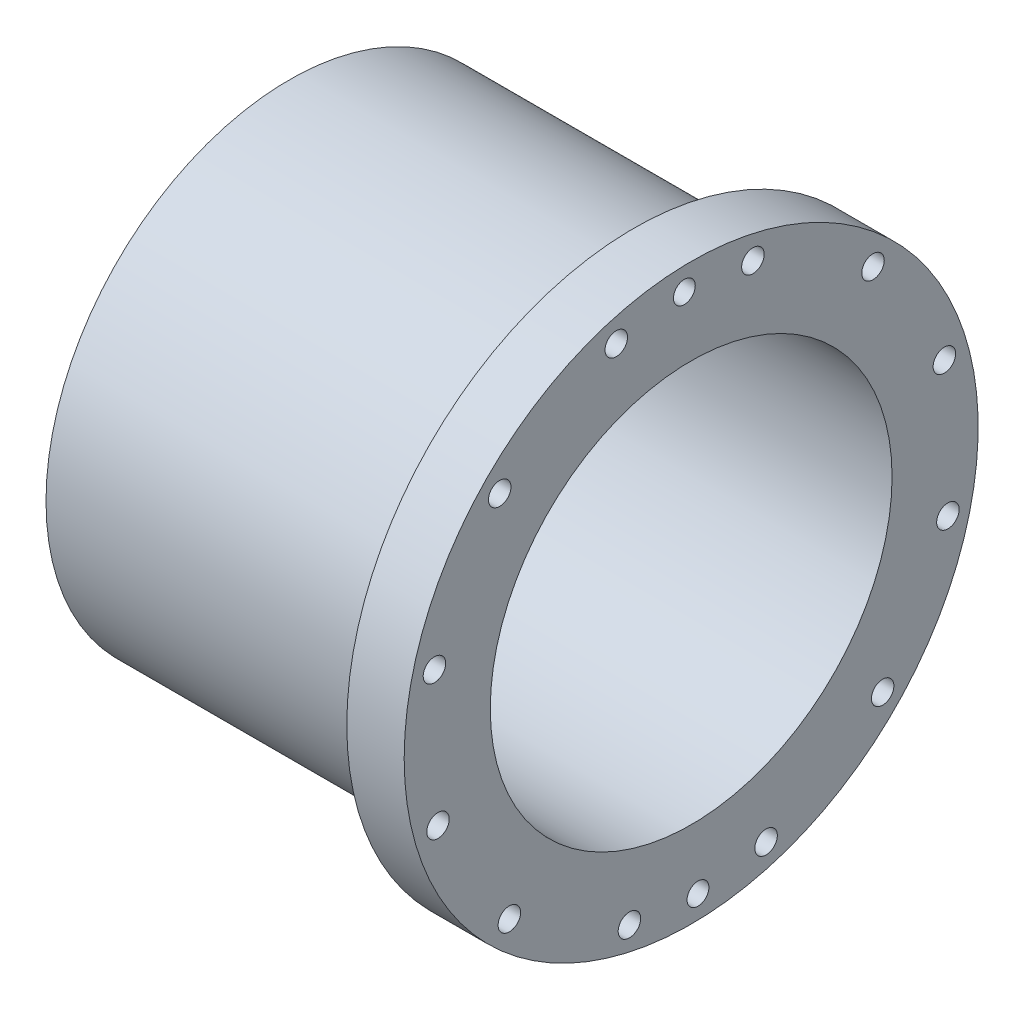
ISO-10303-21;
HEADER;
FILE_DESCRIPTION(('STEP AP214'),'2;1');
FILE_NAME('part.step','',(''),(''),'','','');
FILE_SCHEMA(('AUTOMOTIVE_DESIGN { 1 0 10303 214 1 1 1 1 }'));
ENDSEC;
DATA;
#1=APPLICATION_CONTEXT('core data for automotive mechanical design processes');
#2=APPLICATION_PROTOCOL_DEFINITION('international standard','automotive_design',2000,#1);
#3=PRODUCT_CONTEXT('',#1,'mechanical');
#4=PRODUCT('Part','Part','',(#3));
#5=PRODUCT_RELATED_PRODUCT_CATEGORY('part','',(#4));
#6=PRODUCT_DEFINITION_FORMATION('','',#4);
#7=PRODUCT_DEFINITION_CONTEXT('part definition',#1,'design');
#8=PRODUCT_DEFINITION('design','',#6,#7);
#9=PRODUCT_DEFINITION_SHAPE('','',#8);
#10=(LENGTH_UNIT() NAMED_UNIT(*) SI_UNIT(.MILLI.,.METRE.));
#11=(NAMED_UNIT(*) PLANE_ANGLE_UNIT() SI_UNIT($,.RADIAN.));
#12=(NAMED_UNIT(*) SI_UNIT($,.STERADIAN.) SOLID_ANGLE_UNIT());
#13=UNCERTAINTY_MEASURE_WITH_UNIT(LENGTH_MEASURE(1.E-05),#10,'distance_accuracy_value','');
#14=(GEOMETRIC_REPRESENTATION_CONTEXT(3) GLOBAL_UNCERTAINTY_ASSIGNED_CONTEXT((#13)) GLOBAL_UNIT_ASSIGNED_CONTEXT((#10,
#11,#12)) REPRESENTATION_CONTEXT('',''));
#15=CARTESIAN_POINT('',(0.,0.,0.));
#16=DIRECTION('',(0.,0.,1.));
#17=DIRECTION('',(1.,0.,0.));
#18=AXIS2_PLACEMENT_3D('',#15,#16,#17);
#19=CARTESIAN_POINT('',(-87.2836363636364,0.,0.));
#20=DIRECTION('',(-1.,0.,0.));
#21=DIRECTION('',(0.,0.,1.));
#22=AXIS2_PLACEMENT_3D('',#19,#20,#21);
#23=CYLINDRICAL_SURFACE('',#22,53.848);
#24=CARTESIAN_POINT('',(-88.9,0.,0.));
#25=DIRECTION('',(-1.,0.,0.));
#26=DIRECTION('',(0.,0.,1.));
#27=AXIS2_PLACEMENT_3D('',#24,#25,#26);
#28=CIRCLE('',#27,53.848);
#29=CARTESIAN_POINT('',(-88.9,0.,53.848));
#30=VERTEX_POINT('',#29);
#31=EDGE_CURVE('E11',#30,#30,#28,.T.);
#32=ORIENTED_EDGE('',*,*,#31,.F.);
#33=EDGE_LOOP('',(#32));
#34=FACE_BOUND('',#33,.T.);
#35=CARTESIAN_POINT('',(-12.7,0.,0.));
#36=DIRECTION('',(-1.,0.,0.));
#37=DIRECTION('',(0.,0.,1.));
#38=AXIS2_PLACEMENT_3D('',#35,#36,#37);
#39=CIRCLE('',#38,53.848);
#40=CARTESIAN_POINT('',(-12.7,0.,53.848));
#41=VERTEX_POINT('',#40);
#42=EDGE_CURVE('E164',#41,#41,#39,.T.);
#43=ORIENTED_EDGE('',*,*,#42,.T.);
#44=EDGE_LOOP('',(#43));
#45=FACE_BOUND('',#44,.T.);
#46=ADVANCED_FACE('F34',(#34,#45),#23,.T.);
#47=CARTESIAN_POINT('',(-88.9,53.848,0.));
#48=DIRECTION('',(1.,0.,0.));
#49=DIRECTION('',(0.,0.,-1.));
#50=AXIS2_PLACEMENT_3D('',#47,#48,#49);
#51=PLANE('',#50);
#52=CARTESIAN_POINT('',(-88.9,35.6389185711947,-33.8451131491055));
#53=DIRECTION('',(-1.,0.,0.));
#54=DIRECTION('',(0.,0.,1.));
#55=AXIS2_PLACEMENT_3D('',#52,#53,#54);
#56=CIRCLE('',#55,2.01929999999999);
#57=CARTESIAN_POINT('',(-88.9,35.6389185711947,-31.8258131491055));
#58=VERTEX_POINT('',#57);
#59=EDGE_CURVE('E79',#58,#58,#56,.T.);
#60=ORIENTED_EDGE('',*,*,#59,.F.);
#61=EDGE_LOOP('',(#60));
#62=FACE_BOUND('',#61,.T.);
#63=CARTESIAN_POINT('',(-88.9,49.1326300136069,1.26841197808898));
#64=DIRECTION('',(-1.,0.,0.));
#65=DIRECTION('',(0.,0.,1.));
#66=AXIS2_PLACEMENT_3D('',#63,#64,#65);
#67=CIRCLE('',#66,2.01929999999999);
#68=CARTESIAN_POINT('',(-88.9,49.1326300136069,3.28771197808898));
#69=VERTEX_POINT('',#68);
#70=EDGE_CURVE('E78',#69,#69,#67,.T.);
#71=ORIENTED_EDGE('',*,*,#70,.F.);
#72=EDGE_LOOP('',(#71));
#73=FACE_BOUND('',#72,.T.);
#74=CARTESIAN_POINT('',(-88.9,33.8451131491076,35.6389185711965));
#75=DIRECTION('',(-1.,0.,0.));
#76=DIRECTION('',(0.,0.,1.));
#77=AXIS2_PLACEMENT_3D('',#74,#75,#76);
#78=CIRCLE('',#77,2.01929999999999);
#79=CARTESIAN_POINT('',(-88.9,33.8451131491076,37.6582185711965));
#80=VERTEX_POINT('',#79);
#81=EDGE_CURVE('E91',#80,#80,#78,.T.);
#82=ORIENTED_EDGE('',*,*,#81,.F.);
#83=EDGE_LOOP('',(#82));
#84=FACE_BOUND('',#83,.T.);
#85=CARTESIAN_POINT('',(-88.9,-1.26841197808681,49.1326300136087));
#86=DIRECTION('',(-1.,0.,0.));
#87=DIRECTION('',(0.,0.,1.));
#88=AXIS2_PLACEMENT_3D('',#85,#86,#87);
#89=CIRCLE('',#88,2.0193);
#90=CARTESIAN_POINT('',(-88.9,-1.26841197808681,51.1519300136087));
#91=VERTEX_POINT('',#90);
#92=EDGE_CURVE('E97',#91,#91,#89,.T.);
#93=ORIENTED_EDGE('',*,*,#92,.F.);
#94=EDGE_LOOP('',(#93));
#95=FACE_BOUND('',#94,.T.);
#96=CARTESIAN_POINT('',(-88.9,-35.6389185711944,33.8451131491094));
#97=DIRECTION('',(-1.,0.,0.));
#98=DIRECTION('',(0.,0.,1.));
#99=AXIS2_PLACEMENT_3D('',#96,#97,#98);
#100=CIRCLE('',#99,2.01929999999999);
#101=CARTESIAN_POINT('',(-88.9,-35.6389185711944,35.8644131491094));
#102=VERTEX_POINT('',#101);
#103=EDGE_CURVE('E103',#102,#102,#100,.T.);
#104=ORIENTED_EDGE('',*,*,#103,.F.);
#105=EDGE_LOOP('',(#104));
#106=FACE_BOUND('',#105,.T.);
#107=CARTESIAN_POINT('',(-88.9,-49.1326300136066,-1.26841197808499));
#108=DIRECTION('',(-1.,0.,0.));
#109=DIRECTION('',(0.,0.,1.));
#110=AXIS2_PLACEMENT_3D('',#107,#108,#109);
#111=CIRCLE('',#110,2.01929999999999);
#112=CARTESIAN_POINT('',(-88.9,-49.1326300136066,0.750888021915));
#113=VERTEX_POINT('',#112);
#114=EDGE_CURVE('E109',#113,#113,#111,.T.);
#115=ORIENTED_EDGE('',*,*,#114,.F.);
#116=EDGE_LOOP('',(#115));
#117=FACE_BOUND('',#116,.T.);
#118=CARTESIAN_POINT('',(-88.9,-33.8451131491073,-35.6389185711926));
#119=DIRECTION('',(-1.,0.,0.));
#120=DIRECTION('',(0.,0.,1.));
#121=AXIS2_PLACEMENT_3D('',#118,#119,#120);
#122=CIRCLE('',#121,2.01929999999999);
#123=CARTESIAN_POINT('',(-88.9,-33.8451131491073,-33.6196185711926));
#124=VERTEX_POINT('',#123);
#125=EDGE_CURVE('E115',#124,#124,#122,.T.);
#126=ORIENTED_EDGE('',*,*,#125,.F.);
#127=EDGE_LOOP('',(#126));
#128=FACE_BOUND('',#127,.T.);
#129=CARTESIAN_POINT('',(-88.9,1.26841197808717,-49.1326300136047));
#130=DIRECTION('',(-1.,0.,0.));
#131=DIRECTION('',(0.,0.,1.));
#132=AXIS2_PLACEMENT_3D('',#129,#130,#131);
#133=CIRCLE('',#132,2.0193);
#134=CARTESIAN_POINT('',(-88.9,1.26841197808717,-47.1133300136047));
#135=VERTEX_POINT('',#134);
#136=EDGE_CURVE('E121',#135,#135,#133,.T.);
#137=ORIENTED_EDGE('',*,*,#136,.F.);
#138=EDGE_LOOP('',(#137));
#139=FACE_BOUND('',#138,.T.);
#140=CARTESIAN_POINT('',(-88.9,0.,0.));
#141=DIRECTION('',(-1.,0.,0.));
#142=DIRECTION('',(0.,0.,1.));
#143=AXIS2_PLACEMENT_3D('',#140,#141,#142);
#144=CIRCLE('',#143,44.45);
#145=CARTESIAN_POINT('',(-88.9,0.,44.45));
#146=VERTEX_POINT('',#145);
#147=EDGE_CURVE('E42',#146,#146,#144,.T.);
#148=ORIENTED_EDGE('',*,*,#147,.F.);
#149=EDGE_LOOP('',(#148));
#150=FACE_BOUND('',#149,.T.);
#151=ORIENTED_EDGE('',*,*,#31,.T.);
#152=EDGE_LOOP('',(#151));
#153=FACE_BOUND('',#152,.T.);
#154=ADVANCED_FACE('F232',(#62,#73,#84,#95,#106,#117,#128,#139,#150,#153),#51,.F.);
#155=CARTESIAN_POINT('',(-87.2836363636364,0.,0.));
#156=DIRECTION('',(-1.,0.,0.));
#157=DIRECTION('',(0.,0.,1.));
#158=AXIS2_PLACEMENT_3D('',#155,#156,#157);
#159=CYLINDRICAL_SURFACE('',#158,44.45);
#160=CARTESIAN_POINT('',(0.,0.,0.));
#161=DIRECTION('',(-1.,0.,0.));
#162=DIRECTION('',(0.,0.,1.));
#163=AXIS2_PLACEMENT_3D('',#160,#161,#162);
#164=CIRCLE('',#163,44.45);
#165=CARTESIAN_POINT('',(0.,0.,44.45));
#166=VERTEX_POINT('',#165);
#167=EDGE_CURVE('E173',#166,#166,#164,.T.);
#168=ORIENTED_EDGE('',*,*,#167,.F.);
#169=EDGE_LOOP('',(#168));
#170=FACE_BOUND('',#169,.T.);
#171=ORIENTED_EDGE('',*,*,#147,.T.);
#172=EDGE_LOOP('',(#171));
#173=FACE_BOUND('',#172,.T.);
#174=ADVANCED_FACE('F237',(#170,#173),#159,.F.);
#175=CARTESIAN_POINT('',(0.,44.45,0.));
#176=DIRECTION('',(-1.,0.,0.));
#177=DIRECTION('',(0.,0.,1.));
#178=AXIS2_PLACEMENT_3D('',#175,#176,#177);
#179=PLANE('',#178);
#180=CARTESIAN_POINT('',(0.,58.4005421350349,1.5076731522501));
#181=DIRECTION('',(1.,0.,0.));
#182=DIRECTION('',(0.,0.,-1.));
#183=AXIS2_PLACEMENT_3D('',#180,#181,#182);
#184=CIRCLE('',#183,2.413);
#185=CARTESIAN_POINT('',(0.,58.4005421350349,-0.905326847749895));
#186=VERTEX_POINT('',#185);
#187=EDGE_CURVE('E406',#186,#186,#184,.T.);
#188=ORIENTED_EDGE('',*,*,#187,.F.);
#189=EDGE_LOOP('',(#188));
#190=FACE_BOUND('',#189,.T.);
#191=CARTESIAN_POINT('',(0.,-58.4005421350349,-1.5076731522501));
#192=DIRECTION('',(1.,0.,0.));
#193=DIRECTION('',(0.,0.,-1.));
#194=AXIS2_PLACEMENT_3D('',#191,#192,#193);
#195=CIRCLE('',#194,2.413);
#196=CARTESIAN_POINT('',(0.,-58.4005421350349,-3.9206731522501));
#197=VERTEX_POINT('',#196);
#198=EDGE_CURVE('E413',#197,#197,#195,.T.);
#199=ORIENTED_EDGE('',*,*,#198,.F.);
#200=EDGE_LOOP('',(#199));
#201=FACE_BOUND('',#200,.T.);
#202=CARTESIAN_POINT('',(0.,56.8008064431053,-13.6588721134983));
#203=DIRECTION('',(1.,0.,0.));
#204=DIRECTION('',(0.,0.,-1.));
#205=AXIS2_PLACEMENT_3D('',#202,#203,#204);
#206=CIRCLE('',#205,2.4892);
#207=CARTESIAN_POINT('',(0.,56.8008064431053,-16.1480721134983));
#208=VERTEX_POINT('',#207);
#209=EDGE_CURVE('E137',#208,#208,#206,.T.);
#210=ORIENTED_EDGE('',*,*,#209,.F.);
#211=EDGE_LOOP('',(#210));
#212=FACE_BOUND('',#211,.T.);
#213=CARTESIAN_POINT('',(0.,42.3615052784228,-40.2293334588851));
#214=DIRECTION('',(1.,0.,0.));
#215=DIRECTION('',(0.,0.,-1.));
#216=AXIS2_PLACEMENT_3D('',#213,#214,#215);
#217=CIRCLE('',#216,2.4892);
#218=CARTESIAN_POINT('',(0.,42.3615052784228,-42.7185334588851));
#219=VERTEX_POINT('',#218);
#220=EDGE_CURVE('E141',#219,#219,#217,.T.);
#221=ORIENTED_EDGE('',*,*,#220,.F.);
#222=EDGE_LOOP('',(#221));
#223=FACE_BOUND('',#222,.T.);
#224=CARTESIAN_POINT('',(0.,16.5714729842201,-56.0203773919213));
#225=DIRECTION('',(1.,0.,0.));
#226=DIRECTION('',(0.,0.,-1.));
#227=AXIS2_PLACEMENT_3D('',#224,#225,#226);
#228=CIRCLE('',#227,2.4892);
#229=CARTESIAN_POINT('',(0.,16.5714729842201,-58.5095773919213));
#230=VERTEX_POINT('',#229);
#231=EDGE_CURVE('E144',#230,#230,#228,.T.);
#232=ORIENTED_EDGE('',*,*,#231,.F.);
#233=EDGE_LOOP('',(#232));
#234=FACE_BOUND('',#233,.T.);
#235=CARTESIAN_POINT('',(0.,-13.6588721134985,-56.8008064431055));
#236=DIRECTION('',(1.,0.,0.));
#237=DIRECTION('',(0.,0.,-1.));
#238=AXIS2_PLACEMENT_3D('',#235,#236,#237);
#239=CIRCLE('',#238,2.4892);
#240=CARTESIAN_POINT('',(0.,-13.6588721134985,-59.2900064431055));
#241=VERTEX_POINT('',#240);
#242=EDGE_CURVE('E147',#241,#241,#239,.T.);
#243=ORIENTED_EDGE('',*,*,#242,.F.);
#244=EDGE_LOOP('',(#243));
#245=FACE_BOUND('',#244,.T.);
#246=CARTESIAN_POINT('',(0.,-40.2293334588853,-42.361505278423));
#247=DIRECTION('',(1.,0.,0.));
#248=DIRECTION('',(0.,0.,-1.));
#249=AXIS2_PLACEMENT_3D('',#246,#247,#248);
#250=CIRCLE('',#249,2.4892);
#251=CARTESIAN_POINT('',(0.,-40.2293334588853,-44.850705278423));
#252=VERTEX_POINT('',#251);
#253=EDGE_CURVE('E150',#252,#252,#250,.T.);
#254=ORIENTED_EDGE('',*,*,#253,.F.);
#255=EDGE_LOOP('',(#254));
#256=FACE_BOUND('',#255,.T.);
#257=CARTESIAN_POINT('',(0.,-56.0203773919216,-16.5714729842203));
#258=DIRECTION('',(1.,0.,0.));
#259=DIRECTION('',(0.,0.,-1.));
#260=AXIS2_PLACEMENT_3D('',#257,#258,#259);
#261=CIRCLE('',#260,2.4892);
#262=CARTESIAN_POINT('',(0.,-56.0203773919216,-19.0606729842203));
#263=VERTEX_POINT('',#262);
#264=EDGE_CURVE('E153',#263,#263,#261,.T.);
#265=ORIENTED_EDGE('',*,*,#264,.F.);
#266=EDGE_LOOP('',(#265));
#267=FACE_BOUND('',#266,.T.);
#268=CARTESIAN_POINT('',(0.,-56.8008064431057,13.6588721134983));
#269=DIRECTION('',(1.,0.,0.));
#270=DIRECTION('',(0.,0.,-1.));
#271=AXIS2_PLACEMENT_3D('',#268,#269,#270);
#272=CIRCLE('',#271,2.4892);
#273=CARTESIAN_POINT('',(0.,-56.8008064431057,11.1696721134983));
#274=VERTEX_POINT('',#273);
#275=EDGE_CURVE('E156',#274,#274,#272,.T.);
#276=ORIENTED_EDGE('',*,*,#275,.F.);
#277=EDGE_LOOP('',(#276));
#278=FACE_BOUND('',#277,.T.);
#279=CARTESIAN_POINT('',(0.,-42.3615052784233,40.2293334588851));
#280=DIRECTION('',(1.,0.,0.));
#281=DIRECTION('',(0.,0.,-1.));
#282=AXIS2_PLACEMENT_3D('',#279,#280,#281);
#283=CIRCLE('',#282,2.4892);
#284=CARTESIAN_POINT('',(0.,-42.3615052784233,37.7401334588851));
#285=VERTEX_POINT('',#284);
#286=EDGE_CURVE('E131',#285,#285,#283,.T.);
#287=ORIENTED_EDGE('',*,*,#286,.F.);
#288=EDGE_LOOP('',(#287));
#289=FACE_BOUND('',#288,.T.);
#290=CARTESIAN_POINT('',(0.,-16.5714729842206,56.0203773919213));
#291=DIRECTION('',(1.,0.,0.));
#292=DIRECTION('',(0.,0.,-1.));
#293=AXIS2_PLACEMENT_3D('',#290,#291,#292);
#294=CIRCLE('',#293,2.4892);
#295=CARTESIAN_POINT('',(0.,-16.5714729842206,53.5311773919213));
#296=VERTEX_POINT('',#295);
#297=EDGE_CURVE('E128',#296,#296,#294,.T.);
#298=ORIENTED_EDGE('',*,*,#297,.F.);
#299=EDGE_LOOP('',(#298));
#300=FACE_BOUND('',#299,.T.);
#301=CARTESIAN_POINT('',(0.,13.6588721134981,56.8008064431055));
#302=DIRECTION('',(1.,0.,0.));
#303=DIRECTION('',(0.,0.,-1.));
#304=AXIS2_PLACEMENT_3D('',#301,#302,#303);
#305=CIRCLE('',#304,2.4892);
#306=CARTESIAN_POINT('',(0.,13.6588721134981,54.3116064431055));
#307=VERTEX_POINT('',#306);
#308=EDGE_CURVE('E132',#307,#307,#305,.T.);
#309=ORIENTED_EDGE('',*,*,#308,.F.);
#310=EDGE_LOOP('',(#309));
#311=FACE_BOUND('',#310,.T.);
#312=CARTESIAN_POINT('',(0.,40.2293334588849,42.361505278423));
#313=DIRECTION('',(1.,0.,0.));
#314=DIRECTION('',(0.,0.,-1.));
#315=AXIS2_PLACEMENT_3D('',#312,#313,#314);
#316=CIRCLE('',#315,2.4892);
#317=CARTESIAN_POINT('',(0.,40.2293334588849,39.872305278423));
#318=VERTEX_POINT('',#317);
#319=EDGE_CURVE('E127',#318,#318,#316,.T.);
#320=ORIENTED_EDGE('',*,*,#319,.F.);
#321=EDGE_LOOP('',(#320));
#322=FACE_BOUND('',#321,.T.);
#323=CARTESIAN_POINT('',(0.,56.0203773919211,16.5714729842204));
#324=DIRECTION('',(1.,0.,0.));
#325=DIRECTION('',(0.,0.,-1.));
#326=AXIS2_PLACEMENT_3D('',#323,#324,#325);
#327=CIRCLE('',#326,2.4892);
#328=CARTESIAN_POINT('',(0.,56.0203773919211,14.0822729842204));
#329=VERTEX_POINT('',#328);
#330=EDGE_CURVE('E140',#329,#329,#327,.T.);
#331=ORIENTED_EDGE('',*,*,#330,.F.);
#332=EDGE_LOOP('',(#331));
#333=FACE_BOUND('',#332,.T.);
#334=CARTESIAN_POINT('',(0.,0.,0.));
#335=DIRECTION('',(-1.,0.,0.));
#336=DIRECTION('',(0.,0.,1.));
#337=AXIS2_PLACEMENT_3D('',#334,#335,#336);
#338=CIRCLE('',#337,63.5);
#339=CARTESIAN_POINT('',(0.,0.,63.5));
#340=VERTEX_POINT('',#339);
#341=EDGE_CURVE('E170',#340,#340,#338,.T.);
#342=ORIENTED_EDGE('',*,*,#341,.F.);
#343=EDGE_LOOP('',(#342));
#344=FACE_BOUND('',#343,.T.);
#345=ORIENTED_EDGE('',*,*,#167,.T.);
#346=EDGE_LOOP('',(#345));
#347=FACE_BOUND('',#346,.T.);
#348=ADVANCED_FACE('F252',(#190,#201,#212,#223,#234,#245,#256,#267,#278,#289,#300,#311,#322,
#333,#344,#347),#179,.F.);
#349=CARTESIAN_POINT('',(-87.2836363636364,0.,0.));
#350=DIRECTION('',(-1.,0.,0.));
#351=DIRECTION('',(0.,0.,1.));
#352=AXIS2_PLACEMENT_3D('',#349,#350,#351);
#353=CYLINDRICAL_SURFACE('',#352,63.5);
#354=CARTESIAN_POINT('',(-12.7,0.,0.));
#355=DIRECTION('',(-1.,0.,0.));
#356=DIRECTION('',(0.,0.,1.));
#357=AXIS2_PLACEMENT_3D('',#354,#355,#356);
#358=CIRCLE('',#357,63.5);
#359=CARTESIAN_POINT('',(-12.7,0.,63.5));
#360=VERTEX_POINT('',#359);
#361=EDGE_CURVE('E167',#360,#360,#358,.T.);
#362=ORIENTED_EDGE('',*,*,#361,.F.);
#363=EDGE_LOOP('',(#362));
#364=FACE_BOUND('',#363,.T.);
#365=ORIENTED_EDGE('',*,*,#341,.T.);
#366=EDGE_LOOP('',(#365));
#367=FACE_BOUND('',#366,.T.);
#368=ADVANCED_FACE('F246',(#364,#367),#353,.T.);
#369=CARTESIAN_POINT('',(-12.7,63.5,0.));
#370=DIRECTION('',(1.,0.,0.));
#371=DIRECTION('',(0.,0.,-1.));
#372=AXIS2_PLACEMENT_3D('',#369,#370,#371);
#373=PLANE('',#372);
#374=CARTESIAN_POINT('',(-12.7,56.8008064431053,-13.6588721134983));
#375=DIRECTION('',(1.,0.,0.));
#376=DIRECTION('',(0.,0.,-1.));
#377=AXIS2_PLACEMENT_3D('',#374,#375,#376);
#378=CIRCLE('',#377,2.4892);
#379=CARTESIAN_POINT('',(-12.7,56.8008064431053,-16.1480721134983));
#380=VERTEX_POINT('',#379);
#381=EDGE_CURVE('E37',#380,#380,#378,.T.);
#382=ORIENTED_EDGE('',*,*,#381,.T.);
#383=EDGE_LOOP('',(#382));
#384=FACE_BOUND('',#383,.T.);
#385=CARTESIAN_POINT('',(-12.7,42.3615052784228,-40.2293334588851));
#386=DIRECTION('',(1.,0.,0.));
#387=DIRECTION('',(0.,0.,-1.));
#388=AXIS2_PLACEMENT_3D('',#385,#386,#387);
#389=CIRCLE('',#388,2.4892);
#390=CARTESIAN_POINT('',(-12.7,42.3615052784228,-42.7185334588851));
#391=VERTEX_POINT('',#390);
#392=EDGE_CURVE('E206',#391,#391,#389,.T.);
#393=ORIENTED_EDGE('',*,*,#392,.T.);
#394=EDGE_LOOP('',(#393));
#395=FACE_BOUND('',#394,.T.);
#396=CARTESIAN_POINT('',(-12.7,16.5714729842201,-56.0203773919213));
#397=DIRECTION('',(1.,0.,0.));
#398=DIRECTION('',(0.,0.,-1.));
#399=AXIS2_PLACEMENT_3D('',#396,#397,#398);
#400=CIRCLE('',#399,2.4892);
#401=CARTESIAN_POINT('',(-12.7,16.5714729842201,-58.5095773919213));
#402=VERTEX_POINT('',#401);
#403=EDGE_CURVE('E204',#402,#402,#400,.T.);
#404=ORIENTED_EDGE('',*,*,#403,.T.);
#405=EDGE_LOOP('',(#404));
#406=FACE_BOUND('',#405,.T.);
#407=CARTESIAN_POINT('',(-12.7,-13.6588721134985,-56.8008064431055));
#408=DIRECTION('',(1.,0.,0.));
#409=DIRECTION('',(0.,0.,-1.));
#410=AXIS2_PLACEMENT_3D('',#407,#408,#409);
#411=CIRCLE('',#410,2.4892);
#412=CARTESIAN_POINT('',(-12.7,-13.6588721134985,-59.2900064431055));
#413=VERTEX_POINT('',#412);
#414=EDGE_CURVE('E201',#413,#413,#411,.T.);
#415=ORIENTED_EDGE('',*,*,#414,.T.);
#416=EDGE_LOOP('',(#415));
#417=FACE_BOUND('',#416,.T.);
#418=CARTESIAN_POINT('',(-12.7,-40.2293334588853,-42.361505278423));
#419=DIRECTION('',(1.,0.,0.));
#420=DIRECTION('',(0.,0.,-1.));
#421=AXIS2_PLACEMENT_3D('',#418,#419,#420);
#422=CIRCLE('',#421,2.4892);
#423=CARTESIAN_POINT('',(-12.7,-40.2293334588853,-44.850705278423));
#424=VERTEX_POINT('',#423);
#425=EDGE_CURVE('E198',#424,#424,#422,.T.);
#426=ORIENTED_EDGE('',*,*,#425,.T.);
#427=EDGE_LOOP('',(#426));
#428=FACE_BOUND('',#427,.T.);
#429=CARTESIAN_POINT('',(-12.7,-56.0203773919216,-16.5714729842203));
#430=DIRECTION('',(1.,0.,0.));
#431=DIRECTION('',(0.,0.,-1.));
#432=AXIS2_PLACEMENT_3D('',#429,#430,#431);
#433=CIRCLE('',#432,2.4892);
#434=CARTESIAN_POINT('',(-12.7,-56.0203773919216,-19.0606729842203));
#435=VERTEX_POINT('',#434);
#436=EDGE_CURVE('E195',#435,#435,#433,.T.);
#437=ORIENTED_EDGE('',*,*,#436,.T.);
#438=EDGE_LOOP('',(#437));
#439=FACE_BOUND('',#438,.T.);
#440=CARTESIAN_POINT('',(-12.7,-56.8008064431057,13.6588721134983));
#441=DIRECTION('',(1.,0.,0.));
#442=DIRECTION('',(0.,0.,-1.));
#443=AXIS2_PLACEMENT_3D('',#440,#441,#442);
#444=CIRCLE('',#443,2.4892);
#445=CARTESIAN_POINT('',(-12.7,-56.8008064431057,11.1696721134983));
#446=VERTEX_POINT('',#445);
#447=EDGE_CURVE('E192',#446,#446,#444,.T.);
#448=ORIENTED_EDGE('',*,*,#447,.T.);
#449=EDGE_LOOP('',(#448));
#450=FACE_BOUND('',#449,.T.);
#451=CARTESIAN_POINT('',(-12.7,-42.3615052784233,40.2293334588851));
#452=DIRECTION('',(1.,0.,0.));
#453=DIRECTION('',(0.,0.,-1.));
#454=AXIS2_PLACEMENT_3D('',#451,#452,#453);
#455=CIRCLE('',#454,2.4892);
#456=CARTESIAN_POINT('',(-12.7,-42.3615052784233,37.7401334588851));
#457=VERTEX_POINT('',#456);
#458=EDGE_CURVE('E189',#457,#457,#455,.T.);
#459=ORIENTED_EDGE('',*,*,#458,.T.);
#460=EDGE_LOOP('',(#459));
#461=FACE_BOUND('',#460,.T.);
#462=CARTESIAN_POINT('',(-12.7,-16.5714729842206,56.0203773919213));
#463=DIRECTION('',(1.,0.,0.));
#464=DIRECTION('',(0.,0.,-1.));
#465=AXIS2_PLACEMENT_3D('',#462,#463,#464);
#466=CIRCLE('',#465,2.4892);
#467=CARTESIAN_POINT('',(-12.7,-16.5714729842206,53.5311773919213));
#468=VERTEX_POINT('',#467);
#469=EDGE_CURVE('E186',#468,#468,#466,.T.);
#470=ORIENTED_EDGE('',*,*,#469,.T.);
#471=EDGE_LOOP('',(#470));
#472=FACE_BOUND('',#471,.T.);
#473=CARTESIAN_POINT('',(-12.7,13.6588721134981,56.8008064431055));
#474=DIRECTION('',(1.,0.,0.));
#475=DIRECTION('',(0.,0.,-1.));
#476=AXIS2_PLACEMENT_3D('',#473,#474,#475);
#477=CIRCLE('',#476,2.4892);
#478=CARTESIAN_POINT('',(-12.7,13.6588721134981,54.3116064431055));
#479=VERTEX_POINT('',#478);
#480=EDGE_CURVE('E183',#479,#479,#477,.T.);
#481=ORIENTED_EDGE('',*,*,#480,.T.);
#482=EDGE_LOOP('',(#481));
#483=FACE_BOUND('',#482,.T.);
#484=CARTESIAN_POINT('',(-12.7,40.2293334588849,42.361505278423));
#485=DIRECTION('',(1.,0.,0.));
#486=DIRECTION('',(0.,0.,-1.));
#487=AXIS2_PLACEMENT_3D('',#484,#485,#486);
#488=CIRCLE('',#487,2.4892);
#489=CARTESIAN_POINT('',(-12.7,40.2293334588849,39.872305278423));
#490=VERTEX_POINT('',#489);
#491=EDGE_CURVE('E180',#490,#490,#488,.T.);
#492=ORIENTED_EDGE('',*,*,#491,.T.);
#493=EDGE_LOOP('',(#492));
#494=FACE_BOUND('',#493,.T.);
#495=CARTESIAN_POINT('',(-12.7,56.0203773919211,16.5714729842204));
#496=DIRECTION('',(1.,0.,0.));
#497=DIRECTION('',(0.,0.,-1.));
#498=AXIS2_PLACEMENT_3D('',#495,#496,#497);
#499=CIRCLE('',#498,2.4892);
#500=CARTESIAN_POINT('',(-12.7,56.0203773919211,14.0822729842204));
#501=VERTEX_POINT('',#500);
#502=EDGE_CURVE('E163',#501,#501,#499,.T.);
#503=ORIENTED_EDGE('',*,*,#502,.T.);
#504=EDGE_LOOP('',(#503));
#505=FACE_BOUND('',#504,.T.);
#506=ORIENTED_EDGE('',*,*,#42,.F.);
#507=EDGE_LOOP('',(#506));
#508=FACE_BOUND('',#507,.T.);
#509=ORIENTED_EDGE('',*,*,#361,.T.);
#510=EDGE_LOOP('',(#509));
#511=FACE_BOUND('',#510,.T.);
#512=ADVANCED_FACE('F213',(#384,#395,#406,#417,#428,#439,#450,#461,#472,#483,#494,#505,#508,
#511),#373,.F.);
#513=CARTESIAN_POINT('',(-88.9,56.0203773919211,16.5714729842204));
#514=DIRECTION('',(1.,0.,0.));
#515=DIRECTION('',(0.,0.,-1.));
#516=AXIS2_PLACEMENT_3D('',#513,#514,#515);
#517=CYLINDRICAL_SURFACE('',#516,2.4892);
#518=ORIENTED_EDGE('',*,*,#330,.T.);
#519=EDGE_LOOP('',(#518));
#520=FACE_BOUND('',#519,.T.);
#521=ORIENTED_EDGE('',*,*,#502,.F.);
#522=EDGE_LOOP('',(#521));
#523=FACE_BOUND('',#522,.T.);
#524=ADVANCED_FACE('F245',(#520,#523),#517,.F.);
#525=CARTESIAN_POINT('',(-88.9,40.2293334588849,42.361505278423));
#526=DIRECTION('',(1.,0.,0.));
#527=DIRECTION('',(0.,0.,-1.));
#528=AXIS2_PLACEMENT_3D('',#525,#526,#527);
#529=CYLINDRICAL_SURFACE('',#528,2.4892);
#530=ORIENTED_EDGE('',*,*,#319,.T.);
#531=EDGE_LOOP('',(#530));
#532=FACE_BOUND('',#531,.T.);
#533=ORIENTED_EDGE('',*,*,#491,.F.);
#534=EDGE_LOOP('',(#533));
#535=FACE_BOUND('',#534,.T.);
#536=ADVANCED_FACE('F273',(#532,#535),#529,.F.);
#537=CARTESIAN_POINT('',(-88.9,13.6588721134981,56.8008064431055));
#538=DIRECTION('',(1.,0.,0.));
#539=DIRECTION('',(0.,0.,-1.));
#540=AXIS2_PLACEMENT_3D('',#537,#538,#539);
#541=CYLINDRICAL_SURFACE('',#540,2.4892);
#542=ORIENTED_EDGE('',*,*,#308,.T.);
#543=EDGE_LOOP('',(#542));
#544=FACE_BOUND('',#543,.T.);
#545=ORIENTED_EDGE('',*,*,#480,.F.);
#546=EDGE_LOOP('',(#545));
#547=FACE_BOUND('',#546,.T.);
#548=ADVANCED_FACE('F325',(#544,#547),#541,.F.);
#549=CARTESIAN_POINT('',(-88.9,-16.5714729842206,56.0203773919213));
#550=DIRECTION('',(1.,0.,0.));
#551=DIRECTION('',(0.,0.,-1.));
#552=AXIS2_PLACEMENT_3D('',#549,#550,#551);
#553=CYLINDRICAL_SURFACE('',#552,2.4892);
#554=ORIENTED_EDGE('',*,*,#297,.T.);
#555=EDGE_LOOP('',(#554));
#556=FACE_BOUND('',#555,.T.);
#557=ORIENTED_EDGE('',*,*,#469,.F.);
#558=EDGE_LOOP('',(#557));
#559=FACE_BOUND('',#558,.T.);
#560=ADVANCED_FACE('F279',(#556,#559),#553,.F.);
#561=CARTESIAN_POINT('',(-88.9,-42.3615052784233,40.2293334588851));
#562=DIRECTION('',(1.,0.,0.));
#563=DIRECTION('',(0.,0.,-1.));
#564=AXIS2_PLACEMENT_3D('',#561,#562,#563);
#565=CYLINDRICAL_SURFACE('',#564,2.4892);
#566=ORIENTED_EDGE('',*,*,#286,.T.);
#567=EDGE_LOOP('',(#566));
#568=FACE_BOUND('',#567,.T.);
#569=ORIENTED_EDGE('',*,*,#458,.F.);
#570=EDGE_LOOP('',(#569));
#571=FACE_BOUND('',#570,.T.);
#572=ADVANCED_FACE('F275',(#568,#571),#565,.F.);
#573=CARTESIAN_POINT('',(-88.9,-56.8008064431057,13.6588721134983));
#574=DIRECTION('',(1.,0.,0.));
#575=DIRECTION('',(0.,0.,-1.));
#576=AXIS2_PLACEMENT_3D('',#573,#574,#575);
#577=CYLINDRICAL_SURFACE('',#576,2.4892);
#578=ORIENTED_EDGE('',*,*,#275,.T.);
#579=EDGE_LOOP('',(#578));
#580=FACE_BOUND('',#579,.T.);
#581=ORIENTED_EDGE('',*,*,#447,.F.);
#582=EDGE_LOOP('',(#581));
#583=FACE_BOUND('',#582,.T.);
#584=ADVANCED_FACE('F278',(#580,#583),#577,.F.);
#585=CARTESIAN_POINT('',(-88.9,-56.0203773919216,-16.5714729842203));
#586=DIRECTION('',(1.,0.,0.));
#587=DIRECTION('',(0.,0.,-1.));
#588=AXIS2_PLACEMENT_3D('',#585,#586,#587);
#589=CYLINDRICAL_SURFACE('',#588,2.4892);
#590=ORIENTED_EDGE('',*,*,#264,.T.);
#591=EDGE_LOOP('',(#590));
#592=FACE_BOUND('',#591,.T.);
#593=ORIENTED_EDGE('',*,*,#436,.F.);
#594=EDGE_LOOP('',(#593));
#595=FACE_BOUND('',#594,.T.);
#596=ADVANCED_FACE('F283',(#592,#595),#589,.F.);
#597=CARTESIAN_POINT('',(-88.9,-40.2293334588853,-42.361505278423));
#598=DIRECTION('',(1.,0.,0.));
#599=DIRECTION('',(0.,0.,-1.));
#600=AXIS2_PLACEMENT_3D('',#597,#598,#599);
#601=CYLINDRICAL_SURFACE('',#600,2.4892);
#602=ORIENTED_EDGE('',*,*,#253,.T.);
#603=EDGE_LOOP('',(#602));
#604=FACE_BOUND('',#603,.T.);
#605=ORIENTED_EDGE('',*,*,#425,.F.);
#606=EDGE_LOOP('',(#605));
#607=FACE_BOUND('',#606,.T.);
#608=ADVANCED_FACE('F287',(#604,#607),#601,.F.);
#609=CARTESIAN_POINT('',(-88.9,-13.6588721134985,-56.8008064431055));
#610=DIRECTION('',(1.,0.,0.));
#611=DIRECTION('',(0.,0.,-1.));
#612=AXIS2_PLACEMENT_3D('',#609,#610,#611);
#613=CYLINDRICAL_SURFACE('',#612,2.4892);
#614=ORIENTED_EDGE('',*,*,#242,.T.);
#615=EDGE_LOOP('',(#614));
#616=FACE_BOUND('',#615,.T.);
#617=ORIENTED_EDGE('',*,*,#414,.F.);
#618=EDGE_LOOP('',(#617));
#619=FACE_BOUND('',#618,.T.);
#620=ADVANCED_FACE('F291',(#616,#619),#613,.F.);
#621=CARTESIAN_POINT('',(-88.9,16.5714729842201,-56.0203773919213));
#622=DIRECTION('',(1.,0.,0.));
#623=DIRECTION('',(0.,0.,-1.));
#624=AXIS2_PLACEMENT_3D('',#621,#622,#623);
#625=CYLINDRICAL_SURFACE('',#624,2.4892);
#626=ORIENTED_EDGE('',*,*,#231,.T.);
#627=EDGE_LOOP('',(#626));
#628=FACE_BOUND('',#627,.T.);
#629=ORIENTED_EDGE('',*,*,#403,.F.);
#630=EDGE_LOOP('',(#629));
#631=FACE_BOUND('',#630,.T.);
#632=ADVANCED_FACE('F227',(#628,#631),#625,.F.);
#633=CARTESIAN_POINT('',(-88.9,42.3615052784228,-40.2293334588851));
#634=DIRECTION('',(1.,0.,0.));
#635=DIRECTION('',(0.,0.,-1.));
#636=AXIS2_PLACEMENT_3D('',#633,#634,#635);
#637=CYLINDRICAL_SURFACE('',#636,2.4892);
#638=ORIENTED_EDGE('',*,*,#220,.T.);
#639=EDGE_LOOP('',(#638));
#640=FACE_BOUND('',#639,.T.);
#641=ORIENTED_EDGE('',*,*,#392,.F.);
#642=EDGE_LOOP('',(#641));
#643=FACE_BOUND('',#642,.T.);
#644=ADVANCED_FACE('F218',(#640,#643),#637,.F.);
#645=CARTESIAN_POINT('',(-88.9,56.8008064431053,-13.6588721134983));
#646=DIRECTION('',(1.,0.,0.));
#647=DIRECTION('',(0.,0.,-1.));
#648=AXIS2_PLACEMENT_3D('',#645,#646,#647);
#649=CYLINDRICAL_SURFACE('',#648,2.4892);
#650=ORIENTED_EDGE('',*,*,#209,.T.);
#651=EDGE_LOOP('',(#650));
#652=FACE_BOUND('',#651,.T.);
#653=ORIENTED_EDGE('',*,*,#381,.F.);
#654=EDGE_LOOP('',(#653));
#655=FACE_BOUND('',#654,.T.);
#656=ADVANCED_FACE('F215',(#652,#655),#649,.F.);
#657=CARTESIAN_POINT('',(-71.12,1.26841197808717,-49.1326300136047));
#658=DIRECTION('',(-1.,0.,0.));
#659=DIRECTION('',(0.,0.,1.));
#660=AXIS2_PLACEMENT_3D('',#657,#658,#659);
#661=CONICAL_SURFACE('',#660,2.0193,1.02974425867665);
#662=CARTESIAN_POINT('',(-69.9066821519976,1.26841197808717,-49.1326300136047));
#663=VERTEX_POINT('',#662);
#664=VERTEX_LOOP('',#663);
#665=FACE_BOUND('',#664,.T.);
#666=CARTESIAN_POINT('',(-71.12,1.26841197808717,-49.1326300136047));
#667=DIRECTION('',(-1.,0.,0.));
#668=DIRECTION('',(0.,0.,1.));
#669=AXIS2_PLACEMENT_3D('',#666,#667,#668);
#670=CIRCLE('',#669,2.0193);
#671=CARTESIAN_POINT('',(-71.12,1.26841197808717,-47.1133300136047));
#672=VERTEX_POINT('',#671);
#673=EDGE_CURVE('E124',#672,#672,#670,.T.);
#674=ORIENTED_EDGE('',*,*,#673,.T.);
#675=EDGE_LOOP('',(#674));
#676=FACE_BOUND('',#675,.T.);
#677=ADVANCED_FACE('F217',(#665,#676),#661,.F.);
#678=CARTESIAN_POINT('',(-88.9,1.26841197808717,-49.1326300136047));
#679=DIRECTION('',(-1.,0.,0.));
#680=DIRECTION('',(0.,0.,1.));
#681=AXIS2_PLACEMENT_3D('',#678,#679,#680);
#682=CYLINDRICAL_SURFACE('',#681,2.0193);
#683=ORIENTED_EDGE('',*,*,#673,.F.);
#684=EDGE_LOOP('',(#683));
#685=FACE_BOUND('',#684,.T.);
#686=ORIENTED_EDGE('',*,*,#136,.T.);
#687=EDGE_LOOP('',(#686));
#688=FACE_BOUND('',#687,.T.);
#689=ADVANCED_FACE('F225',(#685,#688),#682,.F.);
#690=CARTESIAN_POINT('',(-71.12,-33.8451131491073,-35.6389185711926));
#691=DIRECTION('',(-1.,0.,0.));
#692=DIRECTION('',(0.,0.,1.));
#693=AXIS2_PLACEMENT_3D('',#690,#691,#692);
#694=CONICAL_SURFACE('',#693,2.01929999999999,1.02974425867665);
#695=CARTESIAN_POINT('',(-69.9066821519976,-33.8451131491073,-35.6389185711926));
#696=VERTEX_POINT('',#695);
#697=VERTEX_LOOP('',#696);
#698=FACE_BOUND('',#697,.T.);
#699=CARTESIAN_POINT('',(-71.12,-33.8451131491073,-35.6389185711926));
#700=DIRECTION('',(-1.,0.,0.));
#701=DIRECTION('',(0.,0.,1.));
#702=AXIS2_PLACEMENT_3D('',#699,#700,#701);
#703=CIRCLE('',#702,2.01929999999999);
#704=CARTESIAN_POINT('',(-71.12,-33.8451131491073,-33.6196185711926));
#705=VERTEX_POINT('',#704);
#706=EDGE_CURVE('E118',#705,#705,#703,.T.);
#707=ORIENTED_EDGE('',*,*,#706,.T.);
#708=EDGE_LOOP('',(#707));
#709=FACE_BOUND('',#708,.T.);
#710=ADVANCED_FACE('F338',(#698,#709),#694,.F.);
#711=CARTESIAN_POINT('',(-88.9,-33.8451131491073,-35.6389185711926));
#712=DIRECTION('',(-1.,0.,0.));
#713=DIRECTION('',(0.,0.,1.));
#714=AXIS2_PLACEMENT_3D('',#711,#712,#713);
#715=CYLINDRICAL_SURFACE('',#714,2.01929999999999);
#716=ORIENTED_EDGE('',*,*,#706,.F.);
#717=EDGE_LOOP('',(#716));
#718=FACE_BOUND('',#717,.T.);
#719=ORIENTED_EDGE('',*,*,#125,.T.);
#720=EDGE_LOOP('',(#719));
#721=FACE_BOUND('',#720,.T.);
#722=ADVANCED_FACE('F342',(#718,#721),#715,.F.);
#723=CARTESIAN_POINT('',(-71.12,-49.1326300136066,-1.26841197808499));
#724=DIRECTION('',(-1.,0.,0.));
#725=DIRECTION('',(0.,0.,1.));
#726=AXIS2_PLACEMENT_3D('',#723,#724,#725);
#727=CONICAL_SURFACE('',#726,2.01929999999999,1.02974425867665);
#728=CARTESIAN_POINT('',(-69.9066821519976,-49.1326300136066,-1.26841197808499));
#729=VERTEX_POINT('',#728);
#730=VERTEX_LOOP('',#729);
#731=FACE_BOUND('',#730,.T.);
#732=CARTESIAN_POINT('',(-71.12,-49.1326300136066,-1.26841197808499));
#733=DIRECTION('',(-1.,0.,0.));
#734=DIRECTION('',(0.,0.,1.));
#735=AXIS2_PLACEMENT_3D('',#732,#733,#734);
#736=CIRCLE('',#735,2.01929999999999);
#737=CARTESIAN_POINT('',(-71.12,-49.1326300136066,0.750888021915));
#738=VERTEX_POINT('',#737);
#739=EDGE_CURVE('E112',#738,#738,#736,.T.);
#740=ORIENTED_EDGE('',*,*,#739,.T.);
#741=EDGE_LOOP('',(#740));
#742=FACE_BOUND('',#741,.T.);
#743=ADVANCED_FACE('F345',(#731,#742),#727,.F.);
#744=CARTESIAN_POINT('',(-88.9,-49.1326300136066,-1.26841197808499));
#745=DIRECTION('',(-1.,0.,0.));
#746=DIRECTION('',(0.,0.,1.));
#747=AXIS2_PLACEMENT_3D('',#744,#745,#746);
#748=CYLINDRICAL_SURFACE('',#747,2.01929999999999);
#749=ORIENTED_EDGE('',*,*,#739,.F.);
#750=EDGE_LOOP('',(#749));
#751=FACE_BOUND('',#750,.T.);
#752=ORIENTED_EDGE('',*,*,#114,.T.);
#753=EDGE_LOOP('',(#752));
#754=FACE_BOUND('',#753,.T.);
#755=ADVANCED_FACE('F349',(#751,#754),#748,.F.);
#756=CARTESIAN_POINT('',(-71.12,-35.6389185711944,33.8451131491094));
#757=DIRECTION('',(-1.,0.,0.));
#758=DIRECTION('',(0.,0.,1.));
#759=AXIS2_PLACEMENT_3D('',#756,#757,#758);
#760=CONICAL_SURFACE('',#759,2.01929999999999,1.02974425867665);
#761=CARTESIAN_POINT('',(-69.9066821519976,-35.6389185711944,33.8451131491094));
#762=VERTEX_POINT('',#761);
#763=VERTEX_LOOP('',#762);
#764=FACE_BOUND('',#763,.T.);
#765=CARTESIAN_POINT('',(-71.12,-35.6389185711944,33.8451131491094));
#766=DIRECTION('',(-1.,0.,0.));
#767=DIRECTION('',(0.,0.,1.));
#768=AXIS2_PLACEMENT_3D('',#765,#766,#767);
#769=CIRCLE('',#768,2.01929999999999);
#770=CARTESIAN_POINT('',(-71.12,-35.6389185711944,35.8644131491094));
#771=VERTEX_POINT('',#770);
#772=EDGE_CURVE('E106',#771,#771,#769,.T.);
#773=ORIENTED_EDGE('',*,*,#772,.T.);
#774=EDGE_LOOP('',(#773));
#775=FACE_BOUND('',#774,.T.);
#776=ADVANCED_FACE('F353',(#764,#775),#760,.F.);
#777=CARTESIAN_POINT('',(-88.9,-35.6389185711944,33.8451131491094));
#778=DIRECTION('',(-1.,0.,0.));
#779=DIRECTION('',(0.,0.,1.));
#780=AXIS2_PLACEMENT_3D('',#777,#778,#779);
#781=CYLINDRICAL_SURFACE('',#780,2.01929999999999);
#782=ORIENTED_EDGE('',*,*,#772,.F.);
#783=EDGE_LOOP('',(#782));
#784=FACE_BOUND('',#783,.T.);
#785=ORIENTED_EDGE('',*,*,#103,.T.);
#786=EDGE_LOOP('',(#785));
#787=FACE_BOUND('',#786,.T.);
#788=ADVANCED_FACE('F357',(#784,#787),#781,.F.);
#789=CARTESIAN_POINT('',(-71.12,-1.26841197808681,49.1326300136087));
#790=DIRECTION('',(-1.,0.,0.));
#791=DIRECTION('',(0.,0.,1.));
#792=AXIS2_PLACEMENT_3D('',#789,#790,#791);
#793=CONICAL_SURFACE('',#792,2.0193,1.02974425867665);
#794=CARTESIAN_POINT('',(-69.9066821519976,-1.26841197808681,49.1326300136087));
#795=VERTEX_POINT('',#794);
#796=VERTEX_LOOP('',#795);
#797=FACE_BOUND('',#796,.T.);
#798=CARTESIAN_POINT('',(-71.12,-1.26841197808681,49.1326300136087));
#799=DIRECTION('',(-1.,0.,0.));
#800=DIRECTION('',(0.,0.,1.));
#801=AXIS2_PLACEMENT_3D('',#798,#799,#800);
#802=CIRCLE('',#801,2.0193);
#803=CARTESIAN_POINT('',(-71.12,-1.26841197808681,51.1519300136087));
#804=VERTEX_POINT('',#803);
#805=EDGE_CURVE('E100',#804,#804,#802,.T.);
#806=ORIENTED_EDGE('',*,*,#805,.T.);
#807=EDGE_LOOP('',(#806));
#808=FACE_BOUND('',#807,.T.);
#809=ADVANCED_FACE('F361',(#797,#808),#793,.F.);
#810=CARTESIAN_POINT('',(-88.9,-1.26841197808681,49.1326300136087));
#811=DIRECTION('',(-1.,0.,0.));
#812=DIRECTION('',(0.,0.,1.));
#813=AXIS2_PLACEMENT_3D('',#810,#811,#812);
#814=CYLINDRICAL_SURFACE('',#813,2.0193);
#815=ORIENTED_EDGE('',*,*,#805,.F.);
#816=EDGE_LOOP('',(#815));
#817=FACE_BOUND('',#816,.T.);
#818=ORIENTED_EDGE('',*,*,#92,.T.);
#819=EDGE_LOOP('',(#818));
#820=FACE_BOUND('',#819,.T.);
#821=ADVANCED_FACE('F365',(#817,#820),#814,.F.);
#822=CARTESIAN_POINT('',(-71.12,33.8451131491076,35.6389185711965));
#823=DIRECTION('',(-1.,0.,0.));
#824=DIRECTION('',(0.,0.,1.));
#825=AXIS2_PLACEMENT_3D('',#822,#823,#824);
#826=CONICAL_SURFACE('',#825,2.01929999999999,1.02974425867665);
#827=CARTESIAN_POINT('',(-69.9066821519976,33.8451131491076,35.6389185711965));
#828=VERTEX_POINT('',#827);
#829=VERTEX_LOOP('',#828);
#830=FACE_BOUND('',#829,.T.);
#831=CARTESIAN_POINT('',(-71.12,33.8451131491076,35.6389185711965));
#832=DIRECTION('',(-1.,0.,0.));
#833=DIRECTION('',(0.,0.,1.));
#834=AXIS2_PLACEMENT_3D('',#831,#832,#833);
#835=CIRCLE('',#834,2.01929999999999);
#836=CARTESIAN_POINT('',(-71.12,33.8451131491076,37.6582185711965));
#837=VERTEX_POINT('',#836);
#838=EDGE_CURVE('E94',#837,#837,#835,.T.);
#839=ORIENTED_EDGE('',*,*,#838,.T.);
#840=EDGE_LOOP('',(#839));
#841=FACE_BOUND('',#840,.T.);
#842=ADVANCED_FACE('F369',(#830,#841),#826,.F.);
#843=CARTESIAN_POINT('',(-88.9,33.8451131491076,35.6389185711965));
#844=DIRECTION('',(-1.,0.,0.));
#845=DIRECTION('',(0.,0.,1.));
#846=AXIS2_PLACEMENT_3D('',#843,#844,#845);
#847=CYLINDRICAL_SURFACE('',#846,2.01929999999999);
#848=ORIENTED_EDGE('',*,*,#838,.F.);
#849=EDGE_LOOP('',(#848));
#850=FACE_BOUND('',#849,.T.);
#851=ORIENTED_EDGE('',*,*,#81,.T.);
#852=EDGE_LOOP('',(#851));
#853=FACE_BOUND('',#852,.T.);
#854=ADVANCED_FACE('F373',(#850,#853),#847,.F.);
#855=CARTESIAN_POINT('',(-71.12,49.1326300136069,1.26841197808898));
#856=DIRECTION('',(-1.,0.,0.));
#857=DIRECTION('',(0.,0.,1.));
#858=AXIS2_PLACEMENT_3D('',#855,#856,#857);
#859=CONICAL_SURFACE('',#858,2.01929999999999,1.02974425867665);
#860=CARTESIAN_POINT('',(-69.9066821519976,49.1326300136069,1.26841197808898));
#861=VERTEX_POINT('',#860);
#862=VERTEX_LOOP('',#861);
#863=FACE_BOUND('',#862,.T.);
#864=CARTESIAN_POINT('',(-71.12,49.1326300136069,1.26841197808898));
#865=DIRECTION('',(-1.,0.,0.));
#866=DIRECTION('',(0.,0.,1.));
#867=AXIS2_PLACEMENT_3D('',#864,#865,#866);
#868=CIRCLE('',#867,2.01929999999999);
#869=CARTESIAN_POINT('',(-71.12,49.1326300136069,3.28771197808898));
#870=VERTEX_POINT('',#869);
#871=EDGE_CURVE('E82',#870,#870,#868,.T.);
#872=ORIENTED_EDGE('',*,*,#871,.T.);
#873=EDGE_LOOP('',(#872));
#874=FACE_BOUND('',#873,.T.);
#875=ADVANCED_FACE('F377',(#863,#874),#859,.F.);
#876=CARTESIAN_POINT('',(-88.9,49.1326300136069,1.26841197808898));
#877=DIRECTION('',(-1.,0.,0.));
#878=DIRECTION('',(0.,0.,1.));
#879=AXIS2_PLACEMENT_3D('',#876,#877,#878);
#880=CYLINDRICAL_SURFACE('',#879,2.01929999999999);
#881=ORIENTED_EDGE('',*,*,#871,.F.);
#882=EDGE_LOOP('',(#881));
#883=FACE_BOUND('',#882,.T.);
#884=ORIENTED_EDGE('',*,*,#70,.T.);
#885=EDGE_LOOP('',(#884));
#886=FACE_BOUND('',#885,.T.);
#887=ADVANCED_FACE('F72',(#883,#886),#880,.F.);
#888=CARTESIAN_POINT('',(-71.12,35.6389185711947,-33.8451131491055));
#889=DIRECTION('',(-1.,0.,0.));
#890=DIRECTION('',(0.,0.,1.));
#891=AXIS2_PLACEMENT_3D('',#888,#889,#890);
#892=CONICAL_SURFACE('',#891,2.01929999999999,1.02974425867665);
#893=CARTESIAN_POINT('',(-69.9066821519976,35.6389185711947,-33.8451131491055));
#894=VERTEX_POINT('',#893);
#895=VERTEX_LOOP('',#894);
#896=FACE_BOUND('',#895,.T.);
#897=CARTESIAN_POINT('',(-71.12,35.6389185711947,-33.8451131491055));
#898=DIRECTION('',(-1.,0.,0.));
#899=DIRECTION('',(0.,0.,1.));
#900=AXIS2_PLACEMENT_3D('',#897,#898,#899);
#901=CIRCLE('',#900,2.01929999999999);
#902=CARTESIAN_POINT('',(-71.12,35.6389185711947,-31.8258131491055));
#903=VERTEX_POINT('',#902);
#904=EDGE_CURVE('E76',#903,#903,#901,.T.);
#905=ORIENTED_EDGE('',*,*,#904,.T.);
#906=EDGE_LOOP('',(#905));
#907=FACE_BOUND('',#906,.T.);
#908=ADVANCED_FACE('F68',(#896,#907),#892,.F.);
#909=CARTESIAN_POINT('',(-88.9,35.6389185711947,-33.8451131491055));
#910=DIRECTION('',(-1.,0.,0.));
#911=DIRECTION('',(0.,0.,1.));
#912=AXIS2_PLACEMENT_3D('',#909,#910,#911);
#913=CYLINDRICAL_SURFACE('',#912,2.01929999999999);
#914=ORIENTED_EDGE('',*,*,#904,.F.);
#915=EDGE_LOOP('',(#914));
#916=FACE_BOUND('',#915,.T.);
#917=ORIENTED_EDGE('',*,*,#59,.T.);
#918=EDGE_LOOP('',(#917));
#919=FACE_BOUND('',#918,.T.);
#920=ADVANCED_FACE('F71',(#916,#919),#913,.F.);
#921=CARTESIAN_POINT('',(-4.826,-58.4005421350349,-1.5076731522501));
#922=DIRECTION('',(1.,0.,0.));
#923=DIRECTION('',(0.,0.,-1.));
#924=AXIS2_PLACEMENT_3D('',#921,#922,#923);
#925=CYLINDRICAL_SURFACE('',#924,2.413);
#926=CARTESIAN_POINT('',(-4.826,-58.4005421350349,-1.5076731522501));
#927=DIRECTION('',(1.,0.,0.));
#928=DIRECTION('',(0.,0.,-1.));
#929=AXIS2_PLACEMENT_3D('',#926,#927,#928);
#930=CIRCLE('',#929,2.413);
#931=CARTESIAN_POINT('',(-4.826,-58.4005421350349,-3.9206731522501));
#932=VERTEX_POINT('',#931);
#933=EDGE_CURVE('E409',#932,#932,#930,.T.);
#934=ORIENTED_EDGE('',*,*,#933,.F.);
#935=EDGE_LOOP('',(#934));
#936=FACE_BOUND('',#935,.T.);
#937=ORIENTED_EDGE('',*,*,#198,.T.);
#938=EDGE_LOOP('',(#937));
#939=FACE_BOUND('',#938,.T.);
#940=ADVANCED_FACE('F387',(#936,#939),#925,.F.);
#941=CARTESIAN_POINT('',(-4.826,-58.4005421350349,-1.5076731522501));
#942=DIRECTION('',(1.,0.,0.));
#943=DIRECTION('',(0.,0.,-1.));
#944=AXIS2_PLACEMENT_3D('',#941,#942,#943);
#945=PLANE('',#944);
#946=ORIENTED_EDGE('',*,*,#933,.T.);
#947=EDGE_LOOP('',(#946));
#948=FACE_BOUND('',#947,.T.);
#949=ADVANCED_FACE('F390',(#948),#945,.T.);
#950=CARTESIAN_POINT('',(-4.826,58.4005421350349,1.5076731522501));
#951=DIRECTION('',(1.,0.,0.));
#952=DIRECTION('',(0.,0.,-1.));
#953=AXIS2_PLACEMENT_3D('',#950,#951,#952);
#954=CYLINDRICAL_SURFACE('',#953,2.413);
#955=CARTESIAN_POINT('',(-4.826,58.4005421350349,1.5076731522501));
#956=DIRECTION('',(1.,0.,0.));
#957=DIRECTION('',(0.,0.,-1.));
#958=AXIS2_PLACEMENT_3D('',#955,#956,#957);
#959=CIRCLE('',#958,2.413);
#960=CARTESIAN_POINT('',(-4.826,58.4005421350349,-0.905326847749895));
#961=VERTEX_POINT('',#960);
#962=EDGE_CURVE('E85',#961,#961,#959,.T.);
#963=ORIENTED_EDGE('',*,*,#962,.F.);
#964=EDGE_LOOP('',(#963));
#965=FACE_BOUND('',#964,.T.);
#966=ORIENTED_EDGE('',*,*,#187,.T.);
#967=EDGE_LOOP('',(#966));
#968=FACE_BOUND('',#967,.T.);
#969=ADVANCED_FACE('F394',(#965,#968),#954,.F.);
#970=CARTESIAN_POINT('',(-4.826,58.4005421350349,1.5076731522501));
#971=DIRECTION('',(1.,0.,0.));
#972=DIRECTION('',(0.,0.,-1.));
#973=AXIS2_PLACEMENT_3D('',#970,#971,#972);
#974=PLANE('',#973);
#975=ORIENTED_EDGE('',*,*,#962,.T.);
#976=EDGE_LOOP('',(#975));
#977=FACE_BOUND('',#976,.T.);
#978=ADVANCED_FACE('F398',(#977),#974,.T.);
#979=CLOSED_SHELL('',(#46,#154,#174,#348,#368,#512,#524,#536,#548,#560,#572,#584,#596,#608,#620,
#632,#644,#656,#677,#689,#710,#722,#743,#755,#776,#788,#809,#821,#842,#854,#875,#887,#908,#920,
#940,#949,#969,#978));
#980=MANIFOLD_SOLID_BREP('B2',#979);
#981=ADVANCED_BREP_SHAPE_REPRESENTATION('',(#18,#980),#14);
#982=SHAPE_DEFINITION_REPRESENTATION(#9,#981);
ENDSEC;
END-ISO-10303-21;
